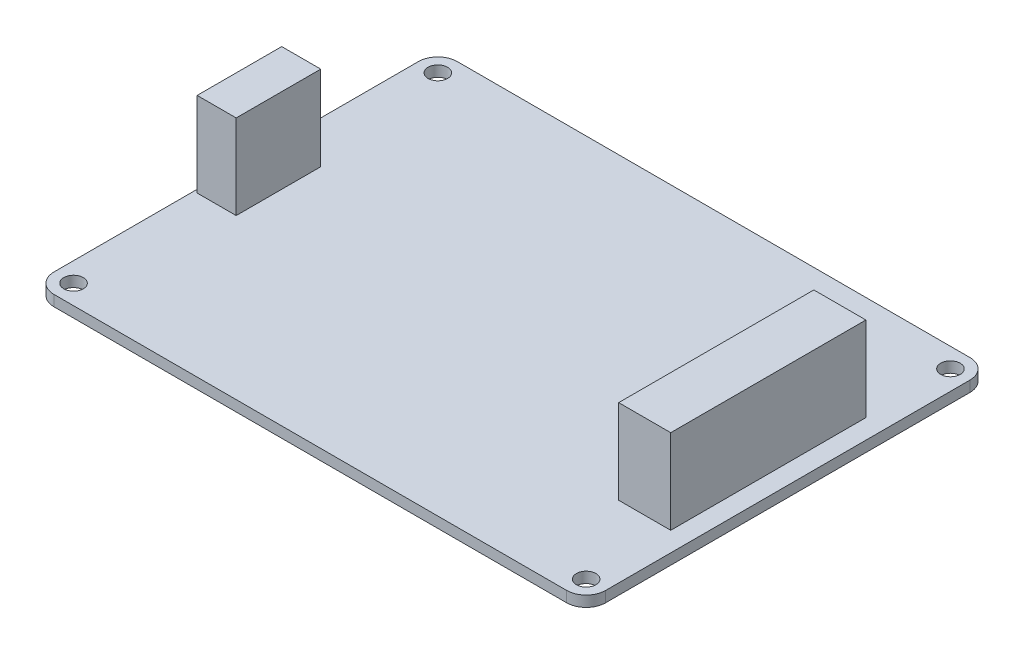
ISO-10303-21;
HEADER;
FILE_DESCRIPTION(('STEP AP214'),'2;1');
FILE_NAME('part.step','',(''),(''),'','','');
FILE_SCHEMA(('AUTOMOTIVE_DESIGN { 1 0 10303 214 1 1 1 1 }'));
ENDSEC;
DATA;
#1=APPLICATION_CONTEXT('core data for automotive mechanical design processes');
#2=APPLICATION_PROTOCOL_DEFINITION('international standard','automotive_design',2000,#1);
#3=PRODUCT_CONTEXT('',#1,'mechanical');
#4=PRODUCT('Part','Part','',(#3));
#5=PRODUCT_RELATED_PRODUCT_CATEGORY('part','',(#4));
#6=PRODUCT_DEFINITION_FORMATION('','',#4);
#7=PRODUCT_DEFINITION_CONTEXT('part definition',#1,'design');
#8=PRODUCT_DEFINITION('design','',#6,#7);
#9=PRODUCT_DEFINITION_SHAPE('','',#8);
#10=(LENGTH_UNIT() NAMED_UNIT(*) SI_UNIT(.MILLI.,.METRE.));
#11=(NAMED_UNIT(*) PLANE_ANGLE_UNIT() SI_UNIT($,.RADIAN.));
#12=(NAMED_UNIT(*) SI_UNIT($,.STERADIAN.) SOLID_ANGLE_UNIT());
#13=UNCERTAINTY_MEASURE_WITH_UNIT(LENGTH_MEASURE(1.E-05),#10,'distance_accuracy_value','');
#14=(GEOMETRIC_REPRESENTATION_CONTEXT(3) GLOBAL_UNCERTAINTY_ASSIGNED_CONTEXT((#13)) GLOBAL_UNIT_ASSIGNED_CONTEXT((#10,
#11,#12)) REPRESENTATION_CONTEXT('',''));
#15=CARTESIAN_POINT('',(0.,0.,0.));
#16=DIRECTION('',(0.,0.,1.));
#17=DIRECTION('',(1.,0.,0.));
#18=AXIS2_PLACEMENT_3D('',#15,#16,#17);
#19=CARTESIAN_POINT('',(0.,1.65,0.));
#20=DIRECTION('',(0.,1.,0.));
#21=DIRECTION('',(0.,0.,1.));
#22=AXIS2_PLACEMENT_3D('',#19,#20,#21);
#23=PLANE('',#22);
#24=CARTESIAN_POINT('',(39.3999999999999,1.65,28.0000000000001));
#25=DIRECTION('',(0.,1.,0.));
#26=DIRECTION('',(0.,0.,1.));
#27=AXIS2_PLACEMENT_3D('',#24,#25,#26);
#28=CIRCLE('',#27,1.50000000000002);
#29=CARTESIAN_POINT('',(39.3999999999999,1.65,29.5000000000002));
#30=VERTEX_POINT('',#29);
#31=EDGE_CURVE('E209',#30,#30,#28,.T.);
#32=ORIENTED_EDGE('',*,*,#31,.F.);
#33=EDGE_LOOP('',(#32));
#34=FACE_BOUND('',#33,.T.);
#35=CARTESIAN_POINT('',(-39.4000000000001,1.65,-28.));
#36=DIRECTION('',(0.,1.,0.));
#37=DIRECTION('',(0.,0.,1.));
#38=AXIS2_PLACEMENT_3D('',#35,#36,#37);
#39=CIRCLE('',#38,1.5);
#40=CARTESIAN_POINT('',(-39.4000000000001,1.65,-26.5));
#41=VERTEX_POINT('',#40);
#42=EDGE_CURVE('E221',#41,#41,#39,.T.);
#43=ORIENTED_EDGE('',*,*,#42,.F.);
#44=EDGE_LOOP('',(#43));
#45=FACE_BOUND('',#44,.T.);
#46=DIRECTION('',(-1.,0.,0.));
#47=VECTOR('',#46,1.);
#48=CARTESIAN_POINT('',(42.3999999999999,1.65,-31.));
#49=LINE('',#48,#47);
#50=CARTESIAN_POINT('',(39.3999999999999,1.65,-31.));
#51=VERTEX_POINT('',#50);
#52=CARTESIAN_POINT('',(-39.4000000000001,1.65,-31.));
#53=VERTEX_POINT('',#52);
#54=EDGE_CURVE('E237',#51,#53,#49,.T.);
#55=ORIENTED_EDGE('',*,*,#54,.T.);
#56=CARTESIAN_POINT('',(-39.4000000000001,1.65,-28.));
#57=DIRECTION('',(0.,1.,0.));
#58=DIRECTION('',(0.,0.,1.));
#59=AXIS2_PLACEMENT_3D('',#56,#57,#58);
#60=CIRCLE('',#59,3.);
#61=CARTESIAN_POINT('',(-42.4000000000001,1.65,-28.));
#62=VERTEX_POINT('',#61);
#63=EDGE_CURVE('E274',#53,#62,#60,.T.);
#64=ORIENTED_EDGE('',*,*,#63,.T.);
#65=DIRECTION('',(0.,0.,1.));
#66=VECTOR('',#65,1.);
#67=CARTESIAN_POINT('',(-42.4000000000001,1.65,30.9999999999998));
#68=LINE('',#67,#66);
#69=CARTESIAN_POINT('',(-42.4000000000001,1.65,27.9999999999998));
#70=VERTEX_POINT('',#69);
#71=EDGE_CURVE('E227',#62,#70,#68,.T.);
#72=ORIENTED_EDGE('',*,*,#71,.T.);
#73=CARTESIAN_POINT('',(-39.4000000000001,1.65,27.9999999999998));
#74=DIRECTION('',(0.,1.,0.));
#75=DIRECTION('',(0.,0.,1.));
#76=AXIS2_PLACEMENT_3D('',#73,#74,#75);
#77=CIRCLE('',#76,3.);
#78=CARTESIAN_POINT('',(-39.4000000000001,1.65,30.9999999999998));
#79=VERTEX_POINT('',#78);
#80=EDGE_CURVE('E268',#70,#79,#77,.T.);
#81=ORIENTED_EDGE('',*,*,#80,.T.);
#82=DIRECTION('',(1.,0.,0.));
#83=VECTOR('',#82,1.);
#84=CARTESIAN_POINT('',(42.3999999999999,1.65,30.9999999999998));
#85=LINE('',#84,#83);
#86=CARTESIAN_POINT('',(39.3999999999999,1.65,30.9999999999998));
#87=VERTEX_POINT('',#86);
#88=EDGE_CURVE('E230',#79,#87,#85,.T.);
#89=ORIENTED_EDGE('',*,*,#88,.T.);
#90=CARTESIAN_POINT('',(39.3999999999999,1.65,27.9999999999998));
#91=DIRECTION('',(0.,1.,0.));
#92=DIRECTION('',(0.,0.,1.));
#93=AXIS2_PLACEMENT_3D('',#90,#91,#92);
#94=CIRCLE('',#93,3.);
#95=CARTESIAN_POINT('',(42.3999999999999,1.65,27.9999999999998));
#96=VERTEX_POINT('',#95);
#97=EDGE_CURVE('E270',#87,#96,#94,.T.);
#98=ORIENTED_EDGE('',*,*,#97,.T.);
#99=DIRECTION('',(0.,0.,-1.));
#100=VECTOR('',#99,1.);
#101=CARTESIAN_POINT('',(42.3999999999999,1.65,30.9999999999998));
#102=LINE('',#101,#100);
#103=CARTESIAN_POINT('',(42.3999999999999,1.65,-28.));
#104=VERTEX_POINT('',#103);
#105=EDGE_CURVE('E234',#96,#104,#102,.T.);
#106=ORIENTED_EDGE('',*,*,#105,.T.);
#107=CARTESIAN_POINT('',(39.3999999999999,1.65,-28.));
#108=DIRECTION('',(0.,1.,0.));
#109=DIRECTION('',(0.,0.,1.));
#110=AXIS2_PLACEMENT_3D('',#107,#108,#109);
#111=CIRCLE('',#110,3.);
#112=EDGE_CURVE('E272',#104,#51,#111,.T.);
#113=ORIENTED_EDGE('',*,*,#112,.T.);
#114=EDGE_LOOP('',(#55,#64,#72,#81,#89,#98,#106,#113));
#115=FACE_BOUND('',#114,.T.);
#116=CARTESIAN_POINT('',(39.3999999999999,1.65,-28.0000000000001));
#117=DIRECTION('',(0.,1.,0.));
#118=DIRECTION('',(0.,0.,-1.));
#119=AXIS2_PLACEMENT_3D('',#116,#117,#118);
#120=CIRCLE('',#119,1.50000000000002);
#121=CARTESIAN_POINT('',(39.3999999999999,1.65,-29.5000000000002));
#122=VERTEX_POINT('',#121);
#123=EDGE_CURVE('E215',#122,#122,#120,.T.);
#124=ORIENTED_EDGE('',*,*,#123,.F.);
#125=EDGE_LOOP('',(#124));
#126=FACE_BOUND('',#125,.T.);
#127=CARTESIAN_POINT('',(-39.4000000000001,1.65,28.));
#128=DIRECTION('',(0.,1.,0.));
#129=DIRECTION('',(0.,0.,-1.));
#130=AXIS2_PLACEMENT_3D('',#127,#128,#129);
#131=CIRCLE('',#130,1.5);
#132=CARTESIAN_POINT('',(-39.4000000000001,1.65,26.5));
#133=VERTEX_POINT('',#132);
#134=EDGE_CURVE('E203',#133,#133,#131,.T.);
#135=ORIENTED_EDGE('',*,*,#134,.F.);
#136=EDGE_LOOP('',(#135));
#137=FACE_BOUND('',#136,.T.);
#138=DIRECTION('',(1.,0.,0.));
#139=VECTOR('',#138,1.);
#140=CARTESIAN_POINT('',(-41.9000000000001,1.65,6.4999999999998));
#141=LINE('',#140,#139);
#142=CARTESIAN_POINT('',(-41.9000000000001,1.65,6.4999999999998));
#143=VERTEX_POINT('',#142);
#144=CARTESIAN_POINT('',(-35.9000000000001,1.65,6.4999999999998));
#145=VERTEX_POINT('',#144);
#146=EDGE_CURVE('E174',#143,#145,#141,.T.);
#147=ORIENTED_EDGE('',*,*,#146,.F.);
#148=DIRECTION('',(0.,0.,1.));
#149=VECTOR('',#148,1.);
#150=CARTESIAN_POINT('',(-41.9000000000001,1.65,-6.5000000000002));
#151=LINE('',#150,#149);
#152=CARTESIAN_POINT('',(-41.9000000000001,1.65,-6.5000000000002));
#153=VERTEX_POINT('',#152);
#154=EDGE_CURVE('E171',#153,#143,#151,.T.);
#155=ORIENTED_EDGE('',*,*,#154,.F.);
#156=DIRECTION('',(-1.,0.,0.));
#157=VECTOR('',#156,1.);
#158=CARTESIAN_POINT('',(-41.9000000000001,1.65,-6.5000000000002));
#159=LINE('',#158,#157);
#160=CARTESIAN_POINT('',(-35.9000000000001,1.65,-6.5000000000002));
#161=VERTEX_POINT('',#160);
#162=EDGE_CURVE('E183',#161,#153,#159,.T.);
#163=ORIENTED_EDGE('',*,*,#162,.F.);
#164=DIRECTION('',(0.,0.,-1.));
#165=VECTOR('',#164,1.);
#166=CARTESIAN_POINT('',(-35.9000000000001,1.65,-6.5000000000002));
#167=LINE('',#166,#165);
#168=EDGE_CURVE('E191',#145,#161,#167,.T.);
#169=ORIENTED_EDGE('',*,*,#168,.F.);
#170=EDGE_LOOP('',(#147,#155,#163,#169));
#171=FACE_BOUND('',#170,.T.);
#172=DIRECTION('',(1.,0.,0.));
#173=VECTOR('',#172,1.);
#174=CARTESIAN_POINT('',(31.3999999999999,1.65,14.9999999999998));
#175=LINE('',#174,#173);
#176=CARTESIAN_POINT('',(31.3999999999999,1.65,14.9999999999998));
#177=VERTEX_POINT('',#176);
#178=CARTESIAN_POINT('',(39.3999999999999,1.65,14.9999999999998));
#179=VERTEX_POINT('',#178);
#180=EDGE_CURVE('E494',#177,#179,#175,.T.);
#181=ORIENTED_EDGE('',*,*,#180,.F.);
#182=DIRECTION('',(0.,0.,1.));
#183=VECTOR('',#182,1.);
#184=CARTESIAN_POINT('',(31.3999999999999,1.65,-15.0000000000002));
#185=LINE('',#184,#183);
#186=CARTESIAN_POINT('',(31.3999999999999,1.65,-15.0000000000002));
#187=VERTEX_POINT('',#186);
#188=EDGE_CURVE('E169',#187,#177,#185,.T.);
#189=ORIENTED_EDGE('',*,*,#188,.F.);
#190=DIRECTION('',(-1.,0.,0.));
#191=VECTOR('',#190,1.);
#192=CARTESIAN_POINT('',(31.3999999999999,1.65,-15.0000000000002));
#193=LINE('',#192,#191);
#194=CARTESIAN_POINT('',(39.3999999999999,1.65,-15.0000000000002));
#195=VERTEX_POINT('',#194);
#196=EDGE_CURVE('E165',#195,#187,#193,.T.);
#197=ORIENTED_EDGE('',*,*,#196,.F.);
#198=DIRECTION('',(0.,0.,-1.));
#199=VECTOR('',#198,1.);
#200=CARTESIAN_POINT('',(39.3999999999999,1.65,-15.0000000000002));
#201=LINE('',#200,#199);
#202=EDGE_CURVE('E496',#179,#195,#201,.T.);
#203=ORIENTED_EDGE('',*,*,#202,.F.);
#204=EDGE_LOOP('',(#181,#189,#197,#203));
#205=FACE_BOUND('',#204,.T.);
#206=ADVANCED_FACE('F33',(#34,#45,#115,#126,#137,#171,#205),#23,.T.);
#207=CARTESIAN_POINT('',(0.,0.,0.));
#208=DIRECTION('',(0.,1.,0.));
#209=DIRECTION('',(0.,0.,1.));
#210=AXIS2_PLACEMENT_3D('',#207,#208,#209);
#211=PLANE('',#210);
#212=DIRECTION('',(0.,0.,1.));
#213=VECTOR('',#212,1.);
#214=CARTESIAN_POINT('',(-42.4000000000001,0.,30.9999999999998));
#215=LINE('',#214,#213);
#216=CARTESIAN_POINT('',(-42.4000000000001,0.,-28.));
#217=VERTEX_POINT('',#216);
#218=CARTESIAN_POINT('',(-42.4000000000001,0.,27.9999999999998));
#219=VERTEX_POINT('',#218);
#220=EDGE_CURVE('E224',#217,#219,#215,.T.);
#221=ORIENTED_EDGE('',*,*,#220,.F.);
#222=CARTESIAN_POINT('',(-39.4000000000001,0.,-28.));
#223=DIRECTION('',(0.,1.,0.));
#224=DIRECTION('',(0.,0.,1.));
#225=AXIS2_PLACEMENT_3D('',#222,#223,#224);
#226=CIRCLE('',#225,3.);
#227=CARTESIAN_POINT('',(-39.4000000000001,0.,-31.));
#228=VERTEX_POINT('',#227);
#229=EDGE_CURVE('E261',#217,#228,#226,.F.);
#230=ORIENTED_EDGE('',*,*,#229,.T.);
#231=DIRECTION('',(-1.,0.,0.));
#232=VECTOR('',#231,1.);
#233=CARTESIAN_POINT('',(42.3999999999999,0.,-31.));
#234=LINE('',#233,#232);
#235=CARTESIAN_POINT('',(39.3999999999999,0.,-31.));
#236=VERTEX_POINT('',#235);
#237=EDGE_CURVE('E231',#236,#228,#234,.T.);
#238=ORIENTED_EDGE('',*,*,#237,.F.);
#239=CARTESIAN_POINT('',(39.3999999999999,0.,-28.));
#240=DIRECTION('',(0.,1.,0.));
#241=DIRECTION('',(0.,0.,1.));
#242=AXIS2_PLACEMENT_3D('',#239,#240,#241);
#243=CIRCLE('',#242,3.);
#244=CARTESIAN_POINT('',(42.3999999999999,0.,-28.));
#245=VERTEX_POINT('',#244);
#246=EDGE_CURVE('E259',#236,#245,#243,.F.);
#247=ORIENTED_EDGE('',*,*,#246,.T.);
#248=DIRECTION('',(0.,0.,-1.));
#249=VECTOR('',#248,1.);
#250=CARTESIAN_POINT('',(42.3999999999999,0.,30.9999999999998));
#251=LINE('',#250,#249);
#252=CARTESIAN_POINT('',(42.3999999999999,0.,27.9999999999998));
#253=VERTEX_POINT('',#252);
#254=EDGE_CURVE('E246',#253,#245,#251,.T.);
#255=ORIENTED_EDGE('',*,*,#254,.F.);
#256=CARTESIAN_POINT('',(39.3999999999999,0.,27.9999999999998));
#257=DIRECTION('',(0.,1.,0.));
#258=DIRECTION('',(0.,0.,1.));
#259=AXIS2_PLACEMENT_3D('',#256,#257,#258);
#260=CIRCLE('',#259,3.);
#261=CARTESIAN_POINT('',(39.3999999999999,0.,30.9999999999998));
#262=VERTEX_POINT('',#261);
#263=EDGE_CURVE('E257',#253,#262,#260,.F.);
#264=ORIENTED_EDGE('',*,*,#263,.T.);
#265=DIRECTION('',(1.,0.,0.));
#266=VECTOR('',#265,1.);
#267=CARTESIAN_POINT('',(42.3999999999999,0.,30.9999999999998));
#268=LINE('',#267,#266);
#269=CARTESIAN_POINT('',(-39.4000000000001,0.,30.9999999999998));
#270=VERTEX_POINT('',#269);
#271=EDGE_CURVE('E243',#270,#262,#268,.T.);
#272=ORIENTED_EDGE('',*,*,#271,.F.);
#273=CARTESIAN_POINT('',(-39.4000000000001,0.,27.9999999999998));
#274=DIRECTION('',(0.,1.,0.));
#275=DIRECTION('',(0.,0.,1.));
#276=AXIS2_PLACEMENT_3D('',#273,#274,#275);
#277=CIRCLE('',#276,3.);
#278=EDGE_CURVE('E255',#270,#219,#277,.F.);
#279=ORIENTED_EDGE('',*,*,#278,.T.);
#280=EDGE_LOOP('',(#221,#230,#238,#247,#255,#264,#272,#279));
#281=FACE_BOUND('',#280,.T.);
#282=CARTESIAN_POINT('',(-39.4000000000001,0.,-28.));
#283=DIRECTION('',(0.,1.,0.));
#284=DIRECTION('',(0.,0.,1.));
#285=AXIS2_PLACEMENT_3D('',#282,#283,#284);
#286=CIRCLE('',#285,1.5);
#287=CARTESIAN_POINT('',(-39.4000000000001,0.,-26.5));
#288=VERTEX_POINT('',#287);
#289=EDGE_CURVE('E218',#288,#288,#286,.T.);
#290=ORIENTED_EDGE('',*,*,#289,.T.);
#291=EDGE_LOOP('',(#290));
#292=FACE_BOUND('',#291,.T.);
#293=CARTESIAN_POINT('',(39.3999999999999,0.,-28.0000000000001));
#294=DIRECTION('',(0.,1.,0.));
#295=DIRECTION('',(0.,0.,-1.));
#296=AXIS2_PLACEMENT_3D('',#293,#294,#295);
#297=CIRCLE('',#296,1.50000000000002);
#298=CARTESIAN_POINT('',(39.3999999999999,0.,-29.5000000000002));
#299=VERTEX_POINT('',#298);
#300=EDGE_CURVE('E212',#299,#299,#297,.T.);
#301=ORIENTED_EDGE('',*,*,#300,.T.);
#302=EDGE_LOOP('',(#301));
#303=FACE_BOUND('',#302,.T.);
#304=CARTESIAN_POINT('',(39.3999999999999,0.,28.0000000000001));
#305=DIRECTION('',(0.,1.,0.));
#306=DIRECTION('',(0.,0.,1.));
#307=AXIS2_PLACEMENT_3D('',#304,#305,#306);
#308=CIRCLE('',#307,1.50000000000002);
#309=CARTESIAN_POINT('',(39.3999999999999,0.,29.5000000000002));
#310=VERTEX_POINT('',#309);
#311=EDGE_CURVE('E206',#310,#310,#308,.T.);
#312=ORIENTED_EDGE('',*,*,#311,.T.);
#313=EDGE_LOOP('',(#312));
#314=FACE_BOUND('',#313,.T.);
#315=CARTESIAN_POINT('',(-39.4000000000001,0.,28.));
#316=DIRECTION('',(0.,1.,0.));
#317=DIRECTION('',(0.,0.,-1.));
#318=AXIS2_PLACEMENT_3D('',#315,#316,#317);
#319=CIRCLE('',#318,1.5);
#320=CARTESIAN_POINT('',(-39.4000000000001,0.,26.5));
#321=VERTEX_POINT('',#320);
#322=EDGE_CURVE('E202',#321,#321,#319,.T.);
#323=ORIENTED_EDGE('',*,*,#322,.T.);
#324=EDGE_LOOP('',(#323));
#325=FACE_BOUND('',#324,.T.);
#326=ADVANCED_FACE('F291',(#281,#292,#303,#314,#325),#211,.F.);
#327=CARTESIAN_POINT('',(-42.4000000000001,1.65,30.9999999999998));
#328=DIRECTION('',(1.,0.,0.));
#329=DIRECTION('',(0.,0.,-1.));
#330=AXIS2_PLACEMENT_3D('',#327,#328,#329);
#331=PLANE('',#330);
#332=ORIENTED_EDGE('',*,*,#71,.F.);
#333=DIRECTION('',(0.,-1.,0.));
#334=VECTOR('',#333,1.);
#335=CARTESIAN_POINT('',(-42.4000000000001,1.65,-28.));
#336=LINE('',#335,#334);
#337=EDGE_CURVE('E252',#62,#217,#336,.T.);
#338=ORIENTED_EDGE('',*,*,#337,.T.);
#339=ORIENTED_EDGE('',*,*,#220,.T.);
#340=DIRECTION('',(0.,-1.,0.));
#341=VECTOR('',#340,1.);
#342=CARTESIAN_POINT('',(-42.4000000000001,1.65,27.9999999999998));
#343=LINE('',#342,#341);
#344=EDGE_CURVE('E240',#219,#70,#343,.F.);
#345=ORIENTED_EDGE('',*,*,#344,.T.);
#346=EDGE_LOOP('',(#332,#338,#339,#345));
#347=FACE_BOUND('',#346,.T.);
#348=ADVANCED_FACE('F319',(#347),#331,.F.);
#349=CARTESIAN_POINT('',(42.3999999999999,1.65,30.9999999999998));
#350=DIRECTION('',(0.,0.,-1.));
#351=DIRECTION('',(-1.,0.,0.));
#352=AXIS2_PLACEMENT_3D('',#349,#350,#351);
#353=PLANE('',#352);
#354=ORIENTED_EDGE('',*,*,#271,.T.);
#355=DIRECTION('',(0.,-1.,0.));
#356=VECTOR('',#355,1.);
#357=CARTESIAN_POINT('',(39.3999999999999,1.65,30.9999999999998));
#358=LINE('',#357,#356);
#359=EDGE_CURVE('E11',#262,#87,#358,.F.);
#360=ORIENTED_EDGE('',*,*,#359,.T.);
#361=ORIENTED_EDGE('',*,*,#88,.F.);
#362=DIRECTION('',(0.,-1.,0.));
#363=VECTOR('',#362,1.);
#364=CARTESIAN_POINT('',(-39.4000000000001,1.65,30.9999999999998));
#365=LINE('',#364,#363);
#366=EDGE_CURVE('E41',#79,#270,#365,.T.);
#367=ORIENTED_EDGE('',*,*,#366,.T.);
#368=EDGE_LOOP('',(#354,#360,#361,#367));
#369=FACE_BOUND('',#368,.T.);
#370=ADVANCED_FACE('F285',(#369),#353,.F.);
#371=CARTESIAN_POINT('',(42.3999999999999,1.65,30.9999999999998));
#372=DIRECTION('',(-1.,0.,0.));
#373=DIRECTION('',(0.,0.,1.));
#374=AXIS2_PLACEMENT_3D('',#371,#372,#373);
#375=PLANE('',#374);
#376=ORIENTED_EDGE('',*,*,#254,.T.);
#377=DIRECTION('',(0.,-1.,0.));
#378=VECTOR('',#377,1.);
#379=CARTESIAN_POINT('',(42.3999999999999,1.65,-28.));
#380=LINE('',#379,#378);
#381=EDGE_CURVE('E279',#245,#104,#380,.F.);
#382=ORIENTED_EDGE('',*,*,#381,.T.);
#383=ORIENTED_EDGE('',*,*,#105,.F.);
#384=DIRECTION('',(0.,-1.,0.));
#385=VECTOR('',#384,1.);
#386=CARTESIAN_POINT('',(42.3999999999999,1.65,27.9999999999998));
#387=LINE('',#386,#385);
#388=EDGE_CURVE('E276',#96,#253,#387,.T.);
#389=ORIENTED_EDGE('',*,*,#388,.T.);
#390=EDGE_LOOP('',(#376,#382,#383,#389));
#391=FACE_BOUND('',#390,.T.);
#392=ADVANCED_FACE('F300',(#391),#375,.F.);
#393=CARTESIAN_POINT('',(42.3999999999999,1.65,-31.));
#394=DIRECTION('',(0.,0.,1.));
#395=DIRECTION('',(1.,0.,0.));
#396=AXIS2_PLACEMENT_3D('',#393,#394,#395);
#397=PLANE('',#396);
#398=ORIENTED_EDGE('',*,*,#237,.T.);
#399=DIRECTION('',(0.,-1.,0.));
#400=VECTOR('',#399,1.);
#401=CARTESIAN_POINT('',(-39.4000000000001,1.65,-31.));
#402=LINE('',#401,#400);
#403=EDGE_CURVE('E266',#228,#53,#402,.F.);
#404=ORIENTED_EDGE('',*,*,#403,.T.);
#405=ORIENTED_EDGE('',*,*,#54,.F.);
#406=DIRECTION('',(0.,-1.,0.));
#407=VECTOR('',#406,1.);
#408=CARTESIAN_POINT('',(39.3999999999999,1.65,-31.));
#409=LINE('',#408,#407);
#410=EDGE_CURVE('E263',#51,#236,#409,.T.);
#411=ORIENTED_EDGE('',*,*,#410,.T.);
#412=EDGE_LOOP('',(#398,#404,#405,#411));
#413=FACE_BOUND('',#412,.T.);
#414=ADVANCED_FACE('F311',(#413),#397,.F.);
#415=CARTESIAN_POINT('',(-39.4000000000001,1.65,-28.));
#416=DIRECTION('',(0.,-1.,0.));
#417=DIRECTION('',(0.,0.,-1.));
#418=AXIS2_PLACEMENT_3D('',#415,#416,#417);
#419=CYLINDRICAL_SURFACE('',#418,1.5);
#420=ORIENTED_EDGE('',*,*,#42,.T.);
#421=EDGE_LOOP('',(#420));
#422=FACE_BOUND('',#421,.T.);
#423=ORIENTED_EDGE('',*,*,#289,.F.);
#424=EDGE_LOOP('',(#423));
#425=FACE_BOUND('',#424,.T.);
#426=ADVANCED_FACE('F340',(#422,#425),#419,.F.);
#427=CARTESIAN_POINT('',(39.3999999999999,1.65,-28.0000000000001));
#428=DIRECTION('',(0.,-1.,0.));
#429=DIRECTION('',(0.,0.,-1.));
#430=AXIS2_PLACEMENT_3D('',#427,#428,#429);
#431=CYLINDRICAL_SURFACE('',#430,1.50000000000002);
#432=ORIENTED_EDGE('',*,*,#123,.T.);
#433=EDGE_LOOP('',(#432));
#434=FACE_BOUND('',#433,.T.);
#435=ORIENTED_EDGE('',*,*,#300,.F.);
#436=EDGE_LOOP('',(#435));
#437=FACE_BOUND('',#436,.T.);
#438=ADVANCED_FACE('F468',(#434,#437),#431,.F.);
#439=CARTESIAN_POINT('',(39.3999999999999,1.65,28.0000000000001));
#440=DIRECTION('',(0.,-1.,0.));
#441=DIRECTION('',(0.,0.,-1.));
#442=AXIS2_PLACEMENT_3D('',#439,#440,#441);
#443=CYLINDRICAL_SURFACE('',#442,1.50000000000002);
#444=ORIENTED_EDGE('',*,*,#31,.T.);
#445=EDGE_LOOP('',(#444));
#446=FACE_BOUND('',#445,.T.);
#447=ORIENTED_EDGE('',*,*,#311,.F.);
#448=EDGE_LOOP('',(#447));
#449=FACE_BOUND('',#448,.T.);
#450=ADVANCED_FACE('F465',(#446,#449),#443,.F.);
#451=CARTESIAN_POINT('',(-39.4000000000001,1.65,28.));
#452=DIRECTION('',(0.,-1.,0.));
#453=DIRECTION('',(0.,0.,-1.));
#454=AXIS2_PLACEMENT_3D('',#451,#452,#453);
#455=CYLINDRICAL_SURFACE('',#454,1.5);
#456=ORIENTED_EDGE('',*,*,#134,.T.);
#457=EDGE_LOOP('',(#456));
#458=FACE_BOUND('',#457,.T.);
#459=ORIENTED_EDGE('',*,*,#322,.F.);
#460=EDGE_LOOP('',(#459));
#461=FACE_BOUND('',#460,.T.);
#462=ADVANCED_FACE('F353',(#458,#461),#455,.F.);
#463=CARTESIAN_POINT('',(-39.4000000000001,1.65,-28.));
#464=DIRECTION('',(0.,-1.,0.));
#465=DIRECTION('',(0.,0.,-1.));
#466=AXIS2_PLACEMENT_3D('',#463,#464,#465);
#467=CYLINDRICAL_SURFACE('',#466,3.);
#468=ORIENTED_EDGE('',*,*,#63,.F.);
#469=ORIENTED_EDGE('',*,*,#403,.F.);
#470=ORIENTED_EDGE('',*,*,#229,.F.);
#471=ORIENTED_EDGE('',*,*,#337,.F.);
#472=EDGE_LOOP('',(#468,#469,#470,#471));
#473=FACE_BOUND('',#472,.T.);
#474=ADVANCED_FACE('F316',(#473),#467,.T.);
#475=CARTESIAN_POINT('',(39.3999999999999,1.65,-28.));
#476=DIRECTION('',(0.,-1.,0.));
#477=DIRECTION('',(0.,0.,-1.));
#478=AXIS2_PLACEMENT_3D('',#475,#476,#477);
#479=CYLINDRICAL_SURFACE('',#478,3.);
#480=ORIENTED_EDGE('',*,*,#112,.F.);
#481=ORIENTED_EDGE('',*,*,#381,.F.);
#482=ORIENTED_EDGE('',*,*,#246,.F.);
#483=ORIENTED_EDGE('',*,*,#410,.F.);
#484=EDGE_LOOP('',(#480,#481,#482,#483));
#485=FACE_BOUND('',#484,.T.);
#486=ADVANCED_FACE('F308',(#485),#479,.T.);
#487=CARTESIAN_POINT('',(39.3999999999999,1.65,27.9999999999998));
#488=DIRECTION('',(0.,-1.,0.));
#489=DIRECTION('',(0.,0.,-1.));
#490=AXIS2_PLACEMENT_3D('',#487,#488,#489);
#491=CYLINDRICAL_SURFACE('',#490,3.);
#492=ORIENTED_EDGE('',*,*,#97,.F.);
#493=ORIENTED_EDGE('',*,*,#359,.F.);
#494=ORIENTED_EDGE('',*,*,#263,.F.);
#495=ORIENTED_EDGE('',*,*,#388,.F.);
#496=EDGE_LOOP('',(#492,#493,#494,#495));
#497=FACE_BOUND('',#496,.T.);
#498=ADVANCED_FACE('F297',(#497),#491,.T.);
#499=CARTESIAN_POINT('',(-39.4000000000001,1.65,27.9999999999998));
#500=DIRECTION('',(0.,-1.,0.));
#501=DIRECTION('',(0.,0.,-1.));
#502=AXIS2_PLACEMENT_3D('',#499,#500,#501);
#503=CYLINDRICAL_SURFACE('',#502,3.);
#504=ORIENTED_EDGE('',*,*,#80,.F.);
#505=ORIENTED_EDGE('',*,*,#344,.F.);
#506=ORIENTED_EDGE('',*,*,#278,.F.);
#507=ORIENTED_EDGE('',*,*,#366,.F.);
#508=EDGE_LOOP('',(#504,#505,#506,#507));
#509=FACE_BOUND('',#508,.T.);
#510=ADVANCED_FACE('F35',(#509),#503,.T.);
#511=CARTESIAN_POINT('',(-41.9000000000001,14.65,-6.5000000000002));
#512=DIRECTION('',(1.,0.,0.));
#513=DIRECTION('',(0.,0.,-1.));
#514=AXIS2_PLACEMENT_3D('',#511,#512,#513);
#515=PLANE('',#514);
#516=ORIENTED_EDGE('',*,*,#154,.T.);
#517=DIRECTION('',(0.,-1.,0.));
#518=VECTOR('',#517,1.);
#519=CARTESIAN_POINT('',(-41.9000000000001,14.65,6.4999999999998));
#520=LINE('',#519,#518);
#521=CARTESIAN_POINT('',(-41.9000000000001,14.65,6.4999999999998));
#522=VERTEX_POINT('',#521);
#523=EDGE_CURVE('E200',#522,#143,#520,.T.);
#524=ORIENTED_EDGE('',*,*,#523,.F.);
#525=DIRECTION('',(0.,0.,1.));
#526=VECTOR('',#525,1.);
#527=CARTESIAN_POINT('',(-41.9000000000001,14.65,-6.5000000000002));
#528=LINE('',#527,#526);
#529=CARTESIAN_POINT('',(-41.9000000000001,14.65,-6.5000000000002));
#530=VERTEX_POINT('',#529);
#531=EDGE_CURVE('E179',#530,#522,#528,.T.);
#532=ORIENTED_EDGE('',*,*,#531,.F.);
#533=DIRECTION('',(0.,-1.,0.));
#534=VECTOR('',#533,1.);
#535=CARTESIAN_POINT('',(-41.9000000000001,14.65,-6.5000000000002));
#536=LINE('',#535,#534);
#537=EDGE_CURVE('E188',#530,#153,#536,.T.);
#538=ORIENTED_EDGE('',*,*,#537,.T.);
#539=EDGE_LOOP('',(#516,#524,#532,#538));
#540=FACE_BOUND('',#539,.T.);
#541=ADVANCED_FACE('F322',(#540),#515,.F.);
#542=CARTESIAN_POINT('',(-41.9000000000001,14.65,6.4999999999998));
#543=DIRECTION('',(0.,0.,-1.));
#544=DIRECTION('',(-1.,0.,0.));
#545=AXIS2_PLACEMENT_3D('',#542,#543,#544);
#546=PLANE('',#545);
#547=ORIENTED_EDGE('',*,*,#146,.T.);
#548=DIRECTION('',(0.,-1.,0.));
#549=VECTOR('',#548,1.);
#550=CARTESIAN_POINT('',(-35.9000000000001,14.65,6.4999999999998));
#551=LINE('',#550,#549);
#552=CARTESIAN_POINT('',(-35.9000000000001,14.65,6.4999999999998));
#553=VERTEX_POINT('',#552);
#554=EDGE_CURVE('E197',#553,#145,#551,.T.);
#555=ORIENTED_EDGE('',*,*,#554,.F.);
#556=DIRECTION('',(1.,0.,0.));
#557=VECTOR('',#556,1.);
#558=CARTESIAN_POINT('',(-41.9000000000001,14.65,6.4999999999998));
#559=LINE('',#558,#557);
#560=EDGE_CURVE('E182',#522,#553,#559,.T.);
#561=ORIENTED_EDGE('',*,*,#560,.F.);
#562=ORIENTED_EDGE('',*,*,#523,.T.);
#563=EDGE_LOOP('',(#547,#555,#561,#562));
#564=FACE_BOUND('',#563,.T.);
#565=ADVANCED_FACE('F327',(#564),#546,.F.);
#566=CARTESIAN_POINT('',(-35.9000000000001,14.65,-6.5000000000002));
#567=DIRECTION('',(-1.,0.,0.));
#568=DIRECTION('',(0.,0.,1.));
#569=AXIS2_PLACEMENT_3D('',#566,#567,#568);
#570=PLANE('',#569);
#571=ORIENTED_EDGE('',*,*,#168,.T.);
#572=DIRECTION('',(0.,-1.,0.));
#573=VECTOR('',#572,1.);
#574=CARTESIAN_POINT('',(-35.9000000000001,14.65,-6.5000000000002));
#575=LINE('',#574,#573);
#576=CARTESIAN_POINT('',(-35.9000000000001,14.65,-6.5000000000002));
#577=VERTEX_POINT('',#576);
#578=EDGE_CURVE('E56',#577,#161,#575,.T.);
#579=ORIENTED_EDGE('',*,*,#578,.F.);
#580=DIRECTION('',(0.,0.,-1.));
#581=VECTOR('',#580,1.);
#582=CARTESIAN_POINT('',(-35.9000000000001,14.65,-6.5000000000002));
#583=LINE('',#582,#581);
#584=EDGE_CURVE('E185',#553,#577,#583,.T.);
#585=ORIENTED_EDGE('',*,*,#584,.F.);
#586=ORIENTED_EDGE('',*,*,#554,.T.);
#587=EDGE_LOOP('',(#571,#579,#585,#586));
#588=FACE_BOUND('',#587,.T.);
#589=ADVANCED_FACE('F387',(#588),#570,.F.);
#590=CARTESIAN_POINT('',(-41.9000000000001,14.65,-6.5000000000002));
#591=DIRECTION('',(0.,0.,1.));
#592=DIRECTION('',(1.,0.,0.));
#593=AXIS2_PLACEMENT_3D('',#590,#591,#592);
#594=PLANE('',#593);
#595=ORIENTED_EDGE('',*,*,#162,.T.);
#596=ORIENTED_EDGE('',*,*,#537,.F.);
#597=DIRECTION('',(-1.,0.,0.));
#598=VECTOR('',#597,1.);
#599=CARTESIAN_POINT('',(-41.9000000000001,14.65,-6.5000000000002));
#600=LINE('',#599,#598);
#601=EDGE_CURVE('E187',#577,#530,#600,.T.);
#602=ORIENTED_EDGE('',*,*,#601,.F.);
#603=ORIENTED_EDGE('',*,*,#578,.T.);
#604=EDGE_LOOP('',(#595,#596,#602,#603));
#605=FACE_BOUND('',#604,.T.);
#606=ADVANCED_FACE('F397',(#605),#594,.F.);
#607=CARTESIAN_POINT('',(0.,14.65,0.));
#608=DIRECTION('',(0.,1.,0.));
#609=DIRECTION('',(0.,0.,1.));
#610=AXIS2_PLACEMENT_3D('',#607,#608,#609);
#611=PLANE('',#610);
#612=ORIENTED_EDGE('',*,*,#531,.T.);
#613=ORIENTED_EDGE('',*,*,#560,.T.);
#614=ORIENTED_EDGE('',*,*,#584,.T.);
#615=ORIENTED_EDGE('',*,*,#601,.T.);
#616=EDGE_LOOP('',(#612,#613,#614,#615));
#617=FACE_BOUND('',#616,.T.);
#618=ADVANCED_FACE('F407',(#617),#611,.T.);
#619=CARTESIAN_POINT('',(31.3999999999999,14.65,-15.0000000000002));
#620=DIRECTION('',(1.,0.,0.));
#621=DIRECTION('',(0.,0.,-1.));
#622=AXIS2_PLACEMENT_3D('',#619,#620,#621);
#623=PLANE('',#622);
#624=ORIENTED_EDGE('',*,*,#188,.T.);
#625=DIRECTION('',(0.,-1.,0.));
#626=VECTOR('',#625,1.);
#627=CARTESIAN_POINT('',(31.3999999999999,14.65,14.9999999999998));
#628=LINE('',#627,#626);
#629=CARTESIAN_POINT('',(31.3999999999999,14.65,14.9999999999998));
#630=VERTEX_POINT('',#629);
#631=EDGE_CURVE('E150',#630,#177,#628,.T.);
#632=ORIENTED_EDGE('',*,*,#631,.F.);
#633=DIRECTION('',(0.,0.,1.));
#634=VECTOR('',#633,1.);
#635=CARTESIAN_POINT('',(31.3999999999999,14.65,-15.0000000000002));
#636=LINE('',#635,#634);
#637=CARTESIAN_POINT('',(31.3999999999999,14.65,-15.0000000000002));
#638=VERTEX_POINT('',#637);
#639=EDGE_CURVE('E157',#638,#630,#636,.T.);
#640=ORIENTED_EDGE('',*,*,#639,.F.);
#641=DIRECTION('',(0.,-1.,0.));
#642=VECTOR('',#641,1.);
#643=CARTESIAN_POINT('',(31.3999999999999,14.65,-15.0000000000002));
#644=LINE('',#643,#642);
#645=EDGE_CURVE('E503',#638,#187,#644,.T.);
#646=ORIENTED_EDGE('',*,*,#645,.T.);
#647=EDGE_LOOP('',(#624,#632,#640,#646));
#648=FACE_BOUND('',#647,.T.);
#649=ADVANCED_FACE('F167',(#648),#623,.F.);
#650=CARTESIAN_POINT('',(31.3999999999999,14.65,14.9999999999998));
#651=DIRECTION('',(0.,0.,-1.));
#652=DIRECTION('',(-1.,0.,0.));
#653=AXIS2_PLACEMENT_3D('',#650,#651,#652);
#654=PLANE('',#653);
#655=ORIENTED_EDGE('',*,*,#180,.T.);
#656=DIRECTION('',(0.,-1.,0.));
#657=VECTOR('',#656,1.);
#658=CARTESIAN_POINT('',(39.3999999999999,14.65,14.9999999999998));
#659=LINE('',#658,#657);
#660=CARTESIAN_POINT('',(39.3999999999999,14.65,14.9999999999998));
#661=VERTEX_POINT('',#660);
#662=EDGE_CURVE('E153',#661,#179,#659,.T.);
#663=ORIENTED_EDGE('',*,*,#662,.F.);
#664=DIRECTION('',(1.,0.,0.));
#665=VECTOR('',#664,1.);
#666=CARTESIAN_POINT('',(31.3999999999999,14.65,14.9999999999998));
#667=LINE('',#666,#665);
#668=EDGE_CURVE('E146',#630,#661,#667,.T.);
#669=ORIENTED_EDGE('',*,*,#668,.F.);
#670=ORIENTED_EDGE('',*,*,#631,.T.);
#671=EDGE_LOOP('',(#655,#663,#669,#670));
#672=FACE_BOUND('',#671,.T.);
#673=ADVANCED_FACE('F148',(#672),#654,.F.);
#674=CARTESIAN_POINT('',(39.3999999999999,14.65,-15.0000000000002));
#675=DIRECTION('',(-1.,0.,0.));
#676=DIRECTION('',(0.,0.,1.));
#677=AXIS2_PLACEMENT_3D('',#674,#675,#676);
#678=PLANE('',#677);
#679=ORIENTED_EDGE('',*,*,#202,.T.);
#680=DIRECTION('',(0.,-1.,0.));
#681=VECTOR('',#680,1.);
#682=CARTESIAN_POINT('',(39.3999999999999,14.65,-15.0000000000002));
#683=LINE('',#682,#681);
#684=CARTESIAN_POINT('',(39.3999999999999,14.65,-15.0000000000002));
#685=VERTEX_POINT('',#684);
#686=EDGE_CURVE('E48',#685,#195,#683,.T.);
#687=ORIENTED_EDGE('',*,*,#686,.F.);
#688=DIRECTION('',(0.,0.,-1.));
#689=VECTOR('',#688,1.);
#690=CARTESIAN_POINT('',(39.3999999999999,14.65,-15.0000000000002));
#691=LINE('',#690,#689);
#692=EDGE_CURVE('E156',#661,#685,#691,.T.);
#693=ORIENTED_EDGE('',*,*,#692,.F.);
#694=ORIENTED_EDGE('',*,*,#662,.T.);
#695=EDGE_LOOP('',(#679,#687,#693,#694));
#696=FACE_BOUND('',#695,.T.);
#697=ADVANCED_FACE('F433',(#696),#678,.F.);
#698=CARTESIAN_POINT('',(31.3999999999999,14.65,-15.0000000000002));
#699=DIRECTION('',(0.,0.,1.));
#700=DIRECTION('',(1.,0.,0.));
#701=AXIS2_PLACEMENT_3D('',#698,#699,#700);
#702=PLANE('',#701);
#703=ORIENTED_EDGE('',*,*,#196,.T.);
#704=ORIENTED_EDGE('',*,*,#645,.F.);
#705=DIRECTION('',(-1.,0.,0.));
#706=VECTOR('',#705,1.);
#707=CARTESIAN_POINT('',(31.3999999999999,14.65,-15.0000000000002));
#708=LINE('',#707,#706);
#709=EDGE_CURVE('E161',#685,#638,#708,.T.);
#710=ORIENTED_EDGE('',*,*,#709,.F.);
#711=ORIENTED_EDGE('',*,*,#686,.T.);
#712=EDGE_LOOP('',(#703,#704,#710,#711));
#713=FACE_BOUND('',#712,.T.);
#714=ADVANCED_FACE('F442',(#713),#702,.F.);
#715=CARTESIAN_POINT('',(0.,14.65,0.));
#716=DIRECTION('',(0.,1.,0.));
#717=DIRECTION('',(0.,0.,1.));
#718=AXIS2_PLACEMENT_3D('',#715,#716,#717);
#719=PLANE('',#718);
#720=ORIENTED_EDGE('',*,*,#639,.T.);
#721=ORIENTED_EDGE('',*,*,#668,.T.);
#722=ORIENTED_EDGE('',*,*,#692,.T.);
#723=ORIENTED_EDGE('',*,*,#709,.T.);
#724=EDGE_LOOP('',(#720,#721,#722,#723));
#725=FACE_BOUND('',#724,.T.);
#726=ADVANCED_FACE('F160',(#725),#719,.T.);
#727=CLOSED_SHELL('',(#206,#326,#348,#370,#392,#414,#426,#438,#450,#462,#474,#486,#498,#510,
#541,#565,#589,#606,#618,#649,#673,#697,#714,#726));
#728=MANIFOLD_SOLID_BREP('B2',#727);
#729=ADVANCED_BREP_SHAPE_REPRESENTATION('',(#18,#728),#14);
#730=SHAPE_DEFINITION_REPRESENTATION(#9,#729);
ENDSEC;
END-ISO-10303-21;
